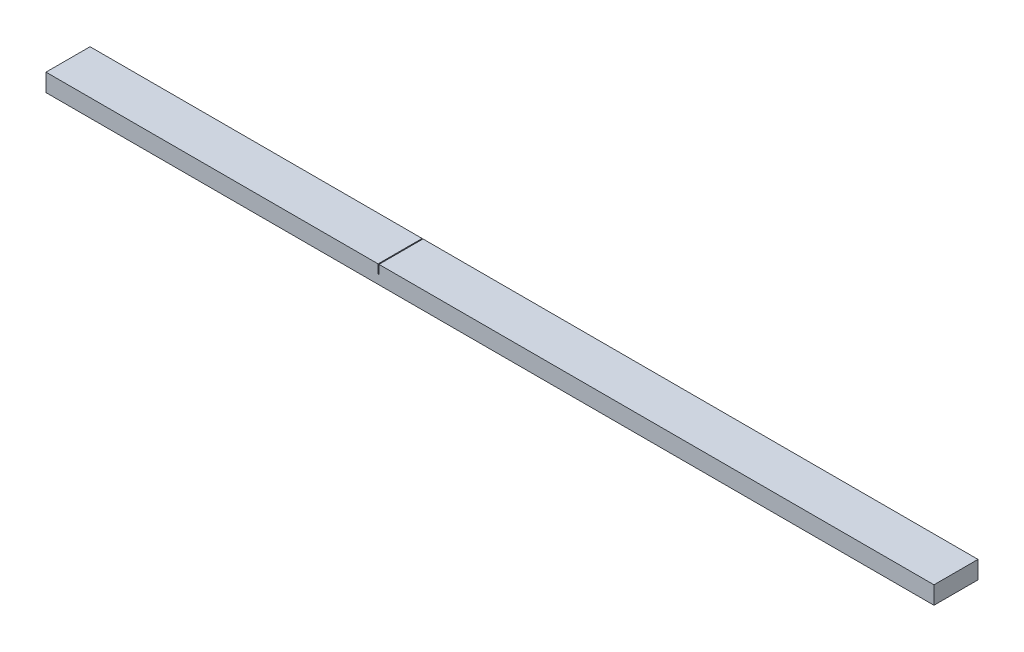
ISO-10303-21;
HEADER;
FILE_DESCRIPTION(('STEP AP214'),'2;1');
FILE_NAME('part.step','',(''),(''),'','','');
FILE_SCHEMA(('AUTOMOTIVE_DESIGN { 1 0 10303 214 1 1 1 1 }'));
ENDSEC;
DATA;
#1=APPLICATION_CONTEXT('core data for automotive mechanical design processes');
#2=APPLICATION_PROTOCOL_DEFINITION('international standard','automotive_design',2000,#1);
#3=PRODUCT_CONTEXT('',#1,'mechanical');
#4=PRODUCT('Part','Part','',(#3));
#5=PRODUCT_RELATED_PRODUCT_CATEGORY('part','',(#4));
#6=PRODUCT_DEFINITION_FORMATION('','',#4);
#7=PRODUCT_DEFINITION_CONTEXT('part definition',#1,'design');
#8=PRODUCT_DEFINITION('design','',#6,#7);
#9=PRODUCT_DEFINITION_SHAPE('','',#8);
#10=(LENGTH_UNIT() NAMED_UNIT(*) SI_UNIT(.MILLI.,.METRE.));
#11=(NAMED_UNIT(*) PLANE_ANGLE_UNIT() SI_UNIT($,.RADIAN.));
#12=(NAMED_UNIT(*) SI_UNIT($,.STERADIAN.) SOLID_ANGLE_UNIT());
#13=UNCERTAINTY_MEASURE_WITH_UNIT(LENGTH_MEASURE(1.E-05),#10,'distance_accuracy_value','');
#14=(GEOMETRIC_REPRESENTATION_CONTEXT(3) GLOBAL_UNCERTAINTY_ASSIGNED_CONTEXT((#13)) GLOBAL_UNIT_ASSIGNED_CONTEXT((#10,
#11,#12)) REPRESENTATION_CONTEXT('',''));
#15=CARTESIAN_POINT('',(0.,0.,0.));
#16=DIRECTION('',(0.,0.,1.));
#17=DIRECTION('',(1.,0.,0.));
#18=AXIS2_PLACEMENT_3D('',#15,#16,#17);
#19=CARTESIAN_POINT('',(1000.,21.8137689614936,-22.4912152025338));
#20=DIRECTION('',(0.,-1.,0.));
#21=DIRECTION('',(0.,0.,-1.));
#22=AXIS2_PLACEMENT_3D('',#19,#20,#21);
#23=PLANE('',#22);
#24=DIRECTION('',(-1.,0.,0.));
#25=VECTOR('',#24,1.);
#26=CARTESIAN_POINT('',(1000.,21.8137689614936,-22.4912152025338));
#27=LINE('',#26,#25);
#28=CARTESIAN_POINT('',(1000.,21.8137689614936,-22.4912152025338));
#29=VERTEX_POINT('',#28);
#30=CARTESIAN_POINT('',(375.,21.8137689614936,-22.4912152025338));
#31=VERTEX_POINT('',#30);
#32=EDGE_CURVE('E11',#29,#31,#27,.T.);
#33=ORIENTED_EDGE('',*,*,#32,.T.);
#34=DIRECTION('',(0.,0.,-1.));
#35=VECTOR('',#34,1.);
#36=CARTESIAN_POINT('',(375.,21.8137689614936,-22.4912152025338));
#37=LINE('',#36,#35);
#38=CARTESIAN_POINT('',(375.,21.8137689614936,27.0978496416069));
#39=VERTEX_POINT('',#38);
#40=EDGE_CURVE('E124',#39,#31,#37,.T.);
#41=ORIENTED_EDGE('',*,*,#40,.F.);
#42=DIRECTION('',(-1.,0.,0.));
#43=VECTOR('',#42,1.);
#44=CARTESIAN_POINT('',(1000.,21.8137689614936,27.0978496416069));
#45=LINE('',#44,#43);
#46=CARTESIAN_POINT('',(1000.,21.8137689614936,27.0978496416069));
#47=VERTEX_POINT('',#46);
#48=EDGE_CURVE('E191',#47,#39,#45,.T.);
#49=ORIENTED_EDGE('',*,*,#48,.F.);
#50=DIRECTION('',(0.,0.,1.));
#51=VECTOR('',#50,1.);
#52=CARTESIAN_POINT('',(1000.,21.8137689614936,-22.4912152025338));
#53=LINE('',#52,#51);
#54=EDGE_CURVE('E97',#29,#47,#53,.T.);
#55=ORIENTED_EDGE('',*,*,#54,.F.);
#56=EDGE_LOOP('',(#33,#41,#49,#55));
#57=FACE_BOUND('',#56,.T.);
#58=ADVANCED_FACE('F44',(#57),#23,.F.);
#59=CARTESIAN_POINT('',(1000.,21.8137689614936,-22.4912152025338));
#60=DIRECTION('',(0.,0.,1.));
#61=DIRECTION('',(0.,-1.,0.));
#62=AXIS2_PLACEMENT_3D('',#59,#60,#61);
#63=PLANE('',#62);
#64=DIRECTION('',(-1.,0.,0.));
#65=VECTOR('',#64,1.);
#66=CARTESIAN_POINT('',(375.,11.8137689614936,-22.4912152025338));
#67=LINE('',#66,#65);
#68=CARTESIAN_POINT('',(375.,11.8137689614936,-22.4912152025338));
#69=VERTEX_POINT('',#68);
#70=CARTESIAN_POINT('',(374.,11.8137689614936,-22.4912152025337));
#71=VERTEX_POINT('',#70);
#72=EDGE_CURVE('E133',#69,#71,#67,.T.);
#73=ORIENTED_EDGE('',*,*,#72,.F.);
#74=DIRECTION('',(0.,1.,0.));
#75=VECTOR('',#74,1.);
#76=CARTESIAN_POINT('',(375.,11.8137689614936,-22.4912152025338));
#77=LINE('',#76,#75);
#78=EDGE_CURVE('E119',#69,#31,#77,.T.);
#79=ORIENTED_EDGE('',*,*,#78,.T.);
#80=ORIENTED_EDGE('',*,*,#32,.F.);
#81=DIRECTION('',(0.,1.,0.));
#82=VECTOR('',#81,1.);
#83=CARTESIAN_POINT('',(1000.,21.8137689614936,-22.4912152025338));
#84=LINE('',#83,#82);
#85=CARTESIAN_POINT('',(1000.,1.81376896149359,-22.4912152025338));
#86=VERTEX_POINT('',#85);
#87=EDGE_CURVE('E164',#86,#29,#84,.T.);
#88=ORIENTED_EDGE('',*,*,#87,.F.);
#89=DIRECTION('',(-1.,0.,0.));
#90=VECTOR('',#89,1.);
#91=CARTESIAN_POINT('',(1000.,1.81376896149359,-22.4912152025338));
#92=LINE('',#91,#90);
#93=CARTESIAN_POINT('',(0.,1.81376896149359,-22.4912152025338));
#94=VERTEX_POINT('',#93);
#95=EDGE_CURVE('E174',#86,#94,#92,.T.);
#96=ORIENTED_EDGE('',*,*,#95,.T.);
#97=DIRECTION('',(0.,1.,0.));
#98=VECTOR('',#97,1.);
#99=CARTESIAN_POINT('',(0.,21.8137689614936,-22.4912152025338));
#100=LINE('',#99,#98);
#101=CARTESIAN_POINT('',(0.,21.8137689614936,-22.4912152025338));
#102=VERTEX_POINT('',#101);
#103=EDGE_CURVE('E157',#94,#102,#100,.T.);
#104=ORIENTED_EDGE('',*,*,#103,.T.);
#105=CARTESIAN_POINT('',(374.,21.8137689614936,-22.4912152025337));
#106=VERTEX_POINT('',#105);
#107=EDGE_CURVE('E53',#106,#102,#27,.T.);
#108=ORIENTED_EDGE('',*,*,#107,.F.);
#109=DIRECTION('',(0.,1.,0.));
#110=VECTOR('',#109,1.);
#111=CARTESIAN_POINT('',(374.,11.8137689614936,-22.4912152025337));
#112=LINE('',#111,#110);
#113=EDGE_CURVE('E129',#71,#106,#112,.T.);
#114=ORIENTED_EDGE('',*,*,#113,.F.);
#115=EDGE_LOOP('',(#73,#79,#80,#88,#96,#104,#108,#114));
#116=FACE_BOUND('',#115,.T.);
#117=ADVANCED_FACE('F46',(#116),#63,.F.);
#118=CARTESIAN_POINT('',(374.,21.8137689614936,27.0978496416069));
#119=VERTEX_POINT('',#118);
#120=CARTESIAN_POINT('',(0.,21.8137689614936,27.0978496416069));
#121=VERTEX_POINT('',#120);
#122=EDGE_CURVE('E190',#119,#121,#45,.T.);
#123=ORIENTED_EDGE('',*,*,#122,.F.);
#124=DIRECTION('',(0.,0.,1.));
#125=VECTOR('',#124,1.);
#126=CARTESIAN_POINT('',(374.,21.8137689614936,-22.4912152025337));
#127=LINE('',#126,#125);
#128=EDGE_CURVE('E138',#106,#119,#127,.T.);
#129=ORIENTED_EDGE('',*,*,#128,.F.);
#130=ORIENTED_EDGE('',*,*,#107,.T.);
#131=DIRECTION('',(0.,0.,1.));
#132=VECTOR('',#131,1.);
#133=CARTESIAN_POINT('',(0.,21.8137689614936,-22.4912152025338));
#134=LINE('',#133,#132);
#135=EDGE_CURVE('E178',#102,#121,#134,.T.);
#136=ORIENTED_EDGE('',*,*,#135,.T.);
#137=EDGE_LOOP('',(#123,#129,#130,#136));
#138=FACE_BOUND('',#137,.T.);
#139=ADVANCED_FACE('F207',(#138),#23,.F.);
#140=CARTESIAN_POINT('',(1000.,21.8137689614936,27.0978496416069));
#141=DIRECTION('',(0.,0.,-1.));
#142=DIRECTION('',(0.,1.,0.));
#143=AXIS2_PLACEMENT_3D('',#140,#141,#142);
#144=PLANE('',#143);
#145=ORIENTED_EDGE('',*,*,#48,.T.);
#146=DIRECTION('',(0.,1.,0.));
#147=VECTOR('',#146,1.);
#148=CARTESIAN_POINT('',(375.,11.8137689614936,27.0978496416069));
#149=LINE('',#148,#147);
#150=CARTESIAN_POINT('',(375.,11.8137689614936,27.0978496416069));
#151=VERTEX_POINT('',#150);
#152=EDGE_CURVE('E154',#151,#39,#149,.T.);
#153=ORIENTED_EDGE('',*,*,#152,.F.);
#154=DIRECTION('',(1.,0.,0.));
#155=VECTOR('',#154,1.);
#156=CARTESIAN_POINT('',(375.,11.8137689614936,27.0978496416069));
#157=LINE('',#156,#155);
#158=CARTESIAN_POINT('',(374.,11.8137689614936,27.0978496416069));
#159=VERTEX_POINT('',#158);
#160=EDGE_CURVE('E130',#159,#151,#157,.T.);
#161=ORIENTED_EDGE('',*,*,#160,.F.);
#162=DIRECTION('',(0.,1.,0.));
#163=VECTOR('',#162,1.);
#164=CARTESIAN_POINT('',(374.,11.8137689614936,27.0978496416069));
#165=LINE('',#164,#163);
#166=EDGE_CURVE('E158',#159,#119,#165,.T.);
#167=ORIENTED_EDGE('',*,*,#166,.T.);
#168=ORIENTED_EDGE('',*,*,#122,.T.);
#169=DIRECTION('',(0.,-1.,0.));
#170=VECTOR('',#169,1.);
#171=CARTESIAN_POINT('',(0.,21.8137689614936,27.0978496416069));
#172=LINE('',#171,#170);
#173=CARTESIAN_POINT('',(0.,1.81376896149358,27.0978496416069));
#174=VERTEX_POINT('',#173);
#175=EDGE_CURVE('E182',#121,#174,#172,.T.);
#176=ORIENTED_EDGE('',*,*,#175,.T.);
#177=DIRECTION('',(-1.,0.,0.));
#178=VECTOR('',#177,1.);
#179=CARTESIAN_POINT('',(1000.,1.81376896149358,27.0978496416069));
#180=LINE('',#179,#178);
#181=CARTESIAN_POINT('',(1000.,1.81376896149358,27.0978496416069));
#182=VERTEX_POINT('',#181);
#183=EDGE_CURVE('E188',#182,#174,#180,.T.);
#184=ORIENTED_EDGE('',*,*,#183,.F.);
#185=DIRECTION('',(0.,-1.,0.));
#186=VECTOR('',#185,1.);
#187=CARTESIAN_POINT('',(1000.,21.8137689614936,27.0978496416069));
#188=LINE('',#187,#186);
#189=EDGE_CURVE('E169',#47,#182,#188,.T.);
#190=ORIENTED_EDGE('',*,*,#189,.F.);
#191=EDGE_LOOP('',(#145,#153,#161,#167,#168,#176,#184,#190));
#192=FACE_BOUND('',#191,.T.);
#193=ADVANCED_FACE('F201',(#192),#144,.F.);
#194=CARTESIAN_POINT('',(1000.,1.81376896149359,-22.4912152025338));
#195=DIRECTION('',(0.,1.,0.));
#196=DIRECTION('',(0.,0.,1.));
#197=AXIS2_PLACEMENT_3D('',#194,#195,#196);
#198=PLANE('',#197);
#199=DIRECTION('',(0.,0.,-1.));
#200=VECTOR('',#199,1.);
#201=CARTESIAN_POINT('',(0.,1.81376896149359,-22.4912152025338));
#202=LINE('',#201,#200);
#203=EDGE_CURVE('E90',#174,#94,#202,.T.);
#204=ORIENTED_EDGE('',*,*,#203,.T.);
#205=ORIENTED_EDGE('',*,*,#95,.F.);
#206=DIRECTION('',(0.,0.,-1.));
#207=VECTOR('',#206,1.);
#208=CARTESIAN_POINT('',(1000.,1.81376896149359,-22.4912152025338));
#209=LINE('',#208,#207);
#210=EDGE_CURVE('E69',#182,#86,#209,.T.);
#211=ORIENTED_EDGE('',*,*,#210,.F.);
#212=ORIENTED_EDGE('',*,*,#183,.T.);
#213=EDGE_LOOP('',(#204,#205,#211,#212));
#214=FACE_BOUND('',#213,.T.);
#215=ADVANCED_FACE('F212',(#214),#198,.F.);
#216=CARTESIAN_POINT('',(1000.,0.,0.));
#217=DIRECTION('',(-1.,0.,0.));
#218=DIRECTION('',(0.,0.,1.));
#219=AXIS2_PLACEMENT_3D('',#216,#217,#218);
#220=PLANE('',#219);
#221=ORIENTED_EDGE('',*,*,#87,.T.);
#222=ORIENTED_EDGE('',*,*,#54,.T.);
#223=ORIENTED_EDGE('',*,*,#189,.T.);
#224=ORIENTED_EDGE('',*,*,#210,.T.);
#225=EDGE_LOOP('',(#221,#222,#223,#224));
#226=FACE_BOUND('',#225,.T.);
#227=ADVANCED_FACE('F213',(#226),#220,.F.);
#228=CARTESIAN_POINT('',(0.,0.,0.));
#229=DIRECTION('',(-1.,0.,0.));
#230=DIRECTION('',(0.,0.,1.));
#231=AXIS2_PLACEMENT_3D('',#228,#229,#230);
#232=PLANE('',#231);
#233=ORIENTED_EDGE('',*,*,#103,.F.);
#234=ORIENTED_EDGE('',*,*,#203,.F.);
#235=ORIENTED_EDGE('',*,*,#175,.F.);
#236=ORIENTED_EDGE('',*,*,#135,.F.);
#237=EDGE_LOOP('',(#233,#234,#235,#236));
#238=FACE_BOUND('',#237,.T.);
#239=ADVANCED_FACE('F210',(#238),#232,.T.);
#240=CARTESIAN_POINT('',(375.,11.8137689614936,-22.4912152025338));
#241=DIRECTION('',(1.,0.,0.));
#242=DIRECTION('',(0.,0.,-1.));
#243=AXIS2_PLACEMENT_3D('',#240,#241,#242);
#244=PLANE('',#243);
#245=ORIENTED_EDGE('',*,*,#40,.T.);
#246=ORIENTED_EDGE('',*,*,#78,.F.);
#247=DIRECTION('',(0.,0.,-1.));
#248=VECTOR('',#247,1.);
#249=CARTESIAN_POINT('',(375.,11.8137689614936,-22.4912152025338));
#250=LINE('',#249,#248);
#251=EDGE_CURVE('E122',#151,#69,#250,.T.);
#252=ORIENTED_EDGE('',*,*,#251,.F.);
#253=ORIENTED_EDGE('',*,*,#152,.T.);
#254=EDGE_LOOP('',(#245,#246,#252,#253));
#255=FACE_BOUND('',#254,.T.);
#256=ADVANCED_FACE('F121',(#255),#244,.F.);
#257=CARTESIAN_POINT('',(374.,11.8137689614936,-22.4912152025337));
#258=DIRECTION('',(-1.,0.,0.));
#259=DIRECTION('',(0.,0.,1.));
#260=AXIS2_PLACEMENT_3D('',#257,#258,#259);
#261=PLANE('',#260);
#262=ORIENTED_EDGE('',*,*,#128,.T.);
#263=ORIENTED_EDGE('',*,*,#166,.F.);
#264=DIRECTION('',(0.,0.,1.));
#265=VECTOR('',#264,1.);
#266=CARTESIAN_POINT('',(374.,11.8137689614936,-22.4912152025337));
#267=LINE('',#266,#265);
#268=EDGE_CURVE('E60',#71,#159,#267,.T.);
#269=ORIENTED_EDGE('',*,*,#268,.F.);
#270=ORIENTED_EDGE('',*,*,#113,.T.);
#271=EDGE_LOOP('',(#262,#263,#269,#270));
#272=FACE_BOUND('',#271,.T.);
#273=ADVANCED_FACE('F231',(#272),#261,.F.);
#274=CARTESIAN_POINT('',(0.,11.8137689614936,0.));
#275=DIRECTION('',(0.,-1.,0.));
#276=DIRECTION('',(0.,0.,-1.));
#277=AXIS2_PLACEMENT_3D('',#274,#275,#276);
#278=PLANE('',#277);
#279=ORIENTED_EDGE('',*,*,#251,.T.);
#280=ORIENTED_EDGE('',*,*,#72,.T.);
#281=ORIENTED_EDGE('',*,*,#268,.T.);
#282=ORIENTED_EDGE('',*,*,#160,.T.);
#283=EDGE_LOOP('',(#279,#280,#281,#282));
#284=FACE_BOUND('',#283,.T.);
#285=ADVANCED_FACE('F132',(#284),#278,.F.);
#286=CLOSED_SHELL('',(#58,#117,#139,#193,#215,#227,#239,#256,#273,#285));
#287=MANIFOLD_SOLID_BREP('B2',#286);
#288=ADVANCED_BREP_SHAPE_REPRESENTATION('',(#18,#287),#14);
#289=SHAPE_DEFINITION_REPRESENTATION(#9,#288);
ENDSEC;
END-ISO-10303-21;
